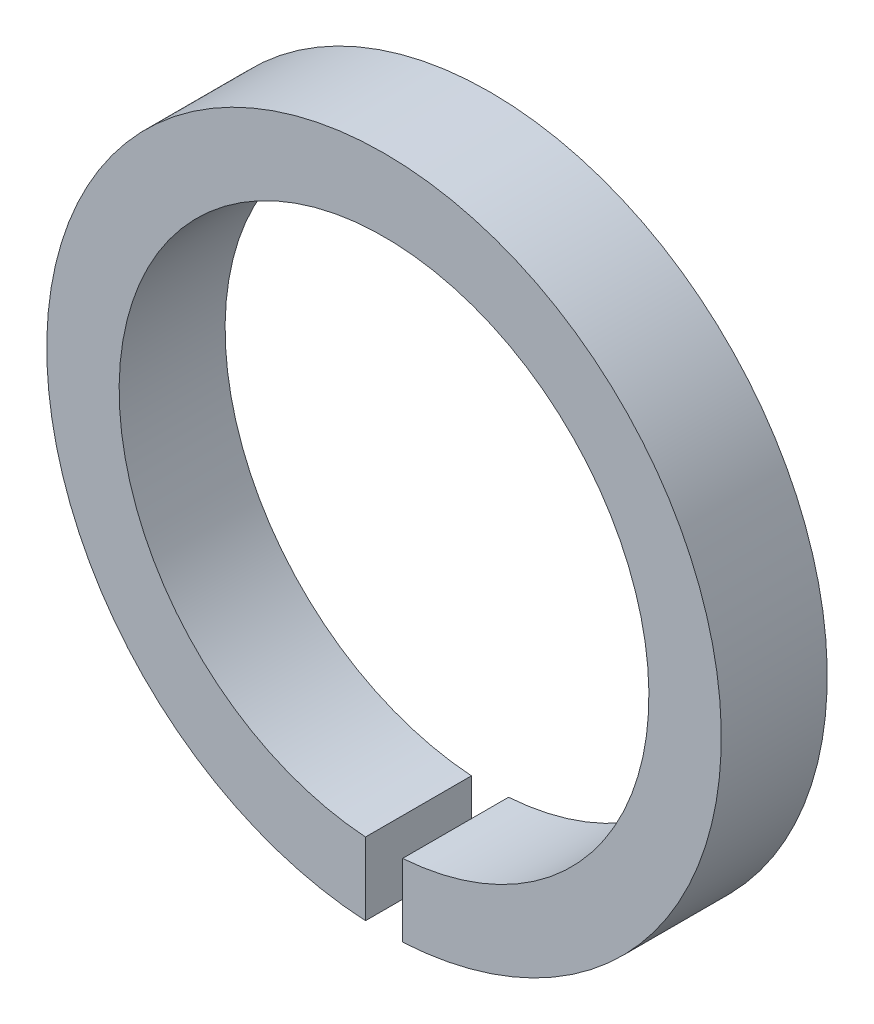
ISO-10303-21;
HEADER;
FILE_DESCRIPTION(('STEP AP214'),'2;1');
FILE_NAME('part.step','',(''),(''),'','','');
FILE_SCHEMA(('AUTOMOTIVE_DESIGN { 1 0 10303 214 1 1 1 1 }'));
ENDSEC;
DATA;
#1=APPLICATION_CONTEXT('core data for automotive mechanical design processes');
#2=APPLICATION_PROTOCOL_DEFINITION('international standard','automotive_design',2000,#1);
#3=PRODUCT_CONTEXT('',#1,'mechanical');
#4=PRODUCT('Part','Part','',(#3));
#5=PRODUCT_RELATED_PRODUCT_CATEGORY('part','',(#4));
#6=PRODUCT_DEFINITION_FORMATION('','',#4);
#7=PRODUCT_DEFINITION_CONTEXT('part definition',#1,'design');
#8=PRODUCT_DEFINITION('design','',#6,#7);
#9=PRODUCT_DEFINITION_SHAPE('','',#8);
#10=(LENGTH_UNIT() NAMED_UNIT(*) SI_UNIT(.MILLI.,.METRE.));
#11=(NAMED_UNIT(*) PLANE_ANGLE_UNIT() SI_UNIT($,.RADIAN.));
#12=(NAMED_UNIT(*) SI_UNIT($,.STERADIAN.) SOLID_ANGLE_UNIT());
#13=UNCERTAINTY_MEASURE_WITH_UNIT(LENGTH_MEASURE(1.E-05),#10,'distance_accuracy_value','');
#14=(GEOMETRIC_REPRESENTATION_CONTEXT(3) GLOBAL_UNCERTAINTY_ASSIGNED_CONTEXT((#13)) GLOBAL_UNIT_ASSIGNED_CONTEXT((#10,
#11,#12)) REPRESENTATION_CONTEXT('',''));
#15=CARTESIAN_POINT('',(0.,0.,0.));
#16=DIRECTION('',(0.,0.,1.));
#17=DIRECTION('',(1.,0.,0.));
#18=AXIS2_PLACEMENT_3D('',#15,#16,#17);
#19=CARTESIAN_POINT('',(0.,0.,5.08));
#20=DIRECTION('',(0.,0.,1.));
#21=DIRECTION('',(1.,0.,0.));
#22=AXIS2_PLACEMENT_3D('',#19,#20,#21);
#23=PLANE('',#22);
#24=DIRECTION('',(0.,-1.,0.));
#25=VECTOR('',#24,1.);
#26=CARTESIAN_POINT('',(-0.889,-0.960137287406383,5.08));
#27=LINE('',#26,#25);
#28=CARTESIAN_POINT('',(-0.888999999999999,-12.6688467904541,5.08));
#29=VERTEX_POINT('',#28);
#30=CARTESIAN_POINT('',(-0.888999999999998,-16.1459628586817,5.08));
#31=VERTEX_POINT('',#30);
#32=EDGE_CURVE('E72',#29,#31,#27,.T.);
#33=ORIENTED_EDGE('',*,*,#32,.F.);
#34=CARTESIAN_POINT('',(0.,0.,5.08));
#35=DIRECTION('',(0.,0.,1.));
#36=DIRECTION('',(1.,0.,0.));
#37=AXIS2_PLACEMENT_3D('',#34,#35,#36);
#38=CIRCLE('',#37,12.7);
#39=CARTESIAN_POINT('',(0.888999999999999,-12.6688467904541,5.08));
#40=VERTEX_POINT('',#39);
#41=EDGE_CURVE('E81',#40,#29,#38,.T.);
#42=ORIENTED_EDGE('',*,*,#41,.F.);
#43=DIRECTION('',(0.,1.,0.));
#44=VECTOR('',#43,1.);
#45=CARTESIAN_POINT('',(0.889,-0.960137287406383,5.08));
#46=LINE('',#45,#44);
#47=CARTESIAN_POINT('',(0.888999999999998,-16.1459628586817,5.08));
#48=VERTEX_POINT('',#47);
#49=EDGE_CURVE('E55',#48,#40,#46,.T.);
#50=ORIENTED_EDGE('',*,*,#49,.F.);
#51=CARTESIAN_POINT('',(0.,0.,5.08));
#52=DIRECTION('',(0.,0.,1.));
#53=DIRECTION('',(1.,0.,0.));
#54=AXIS2_PLACEMENT_3D('',#51,#52,#53);
#55=CIRCLE('',#54,16.170418597981);
#56=EDGE_CURVE('E83',#48,#31,#55,.T.);
#57=ORIENTED_EDGE('',*,*,#56,.T.);
#58=EDGE_LOOP('',(#33,#42,#50,#57));
#59=FACE_BOUND('',#58,.T.);
#60=ADVANCED_FACE('F33',(#59),#23,.T.);
#61=CARTESIAN_POINT('',(0.,0.,0.));
#62=DIRECTION('',(0.,0.,1.));
#63=DIRECTION('',(1.,0.,0.));
#64=AXIS2_PLACEMENT_3D('',#61,#62,#63);
#65=PLANE('',#64);
#66=CARTESIAN_POINT('',(0.,0.,0.));
#67=DIRECTION('',(0.,0.,1.));
#68=DIRECTION('',(1.,0.,0.));
#69=AXIS2_PLACEMENT_3D('',#66,#67,#68);
#70=CIRCLE('',#69,12.7);
#71=CARTESIAN_POINT('',(0.888999999999999,-12.6688467904541,0.));
#72=VERTEX_POINT('',#71);
#73=CARTESIAN_POINT('',(-0.888999999999999,-12.6688467904541,0.));
#74=VERTEX_POINT('',#73);
#75=EDGE_CURVE('E87',#72,#74,#70,.T.);
#76=ORIENTED_EDGE('',*,*,#75,.T.);
#77=DIRECTION('',(0.,-1.,0.));
#78=VECTOR('',#77,1.);
#79=CARTESIAN_POINT('',(-0.889,-0.960137287406383,0.));
#80=LINE('',#79,#78);
#81=CARTESIAN_POINT('',(-0.888999999999998,-16.1459628586817,0.));
#82=VERTEX_POINT('',#81);
#83=EDGE_CURVE('E47',#74,#82,#80,.T.);
#84=ORIENTED_EDGE('',*,*,#83,.T.);
#85=CARTESIAN_POINT('',(0.,0.,0.));
#86=DIRECTION('',(0.,0.,1.));
#87=DIRECTION('',(1.,0.,0.));
#88=AXIS2_PLACEMENT_3D('',#85,#86,#87);
#89=CIRCLE('',#88,16.170418597981);
#90=CARTESIAN_POINT('',(0.888999999999998,-16.1459628586817,0.));
#91=VERTEX_POINT('',#90);
#92=EDGE_CURVE('E86',#91,#82,#89,.T.);
#93=ORIENTED_EDGE('',*,*,#92,.F.);
#94=DIRECTION('',(0.,1.,0.));
#95=VECTOR('',#94,1.);
#96=CARTESIAN_POINT('',(0.889,-0.960137287406383,0.));
#97=LINE('',#96,#95);
#98=EDGE_CURVE('E98',#91,#72,#97,.T.);
#99=ORIENTED_EDGE('',*,*,#98,.T.);
#100=EDGE_LOOP('',(#76,#84,#93,#99));
#101=FACE_BOUND('',#100,.T.);
#102=ADVANCED_FACE('F102',(#101),#65,.F.);
#103=CARTESIAN_POINT('',(0.,0.,5.08));
#104=DIRECTION('',(0.,0.,-1.));
#105=DIRECTION('',(-1.,0.,0.));
#106=AXIS2_PLACEMENT_3D('',#103,#104,#105);
#107=CYLINDRICAL_SURFACE('',#106,16.170418597981);
#108=ORIENTED_EDGE('',*,*,#92,.T.);
#109=DIRECTION('',(0.,0.,-1.));
#110=VECTOR('',#109,1.);
#111=CARTESIAN_POINT('',(-0.888999999999998,-16.1459628586817,5.08));
#112=LINE('',#111,#110);
#113=EDGE_CURVE('E91',#82,#31,#112,.F.);
#114=ORIENTED_EDGE('',*,*,#113,.T.);
#115=ORIENTED_EDGE('',*,*,#56,.F.);
#116=DIRECTION('',(0.,0.,-1.));
#117=VECTOR('',#116,1.);
#118=CARTESIAN_POINT('',(0.888999999999998,-16.1459628586817,5.08));
#119=LINE('',#118,#117);
#120=EDGE_CURVE('E103',#48,#91,#119,.T.);
#121=ORIENTED_EDGE('',*,*,#120,.T.);
#122=EDGE_LOOP('',(#108,#114,#115,#121));
#123=FACE_BOUND('',#122,.T.);
#124=ADVANCED_FACE('F35',(#123),#107,.T.);
#125=CARTESIAN_POINT('',(0.,0.,5.08));
#126=DIRECTION('',(0.,0.,-1.));
#127=DIRECTION('',(-1.,0.,0.));
#128=AXIS2_PLACEMENT_3D('',#125,#126,#127);
#129=CYLINDRICAL_SURFACE('',#128,12.7);
#130=DIRECTION('',(0.,0.,-1.));
#131=VECTOR('',#130,1.);
#132=CARTESIAN_POINT('',(-0.888999999999999,-12.6688467904541,5.08));
#133=LINE('',#132,#131);
#134=EDGE_CURVE('E11',#74,#29,#133,.F.);
#135=ORIENTED_EDGE('',*,*,#134,.F.);
#136=ORIENTED_EDGE('',*,*,#75,.F.);
#137=DIRECTION('',(0.,0.,-1.));
#138=VECTOR('',#137,1.);
#139=CARTESIAN_POINT('',(0.888999999999999,-12.6688467904541,5.08));
#140=LINE('',#139,#138);
#141=EDGE_CURVE('E41',#40,#72,#140,.T.);
#142=ORIENTED_EDGE('',*,*,#141,.F.);
#143=ORIENTED_EDGE('',*,*,#41,.T.);
#144=EDGE_LOOP('',(#135,#136,#142,#143));
#145=FACE_BOUND('',#144,.T.);
#146=ADVANCED_FACE('F85',(#145),#129,.F.);
#147=CARTESIAN_POINT('',(0.889,-0.960137287406383,0.));
#148=DIRECTION('',(1.,0.,0.));
#149=DIRECTION('',(0.,1.,0.));
#150=AXIS2_PLACEMENT_3D('',#147,#148,#149);
#151=PLANE('',#150);
#152=ORIENTED_EDGE('',*,*,#49,.T.);
#153=ORIENTED_EDGE('',*,*,#141,.T.);
#154=ORIENTED_EDGE('',*,*,#98,.F.);
#155=ORIENTED_EDGE('',*,*,#120,.F.);
#156=EDGE_LOOP('',(#152,#153,#154,#155));
#157=FACE_BOUND('',#156,.T.);
#158=ADVANCED_FACE('F97',(#157),#151,.F.);
#159=CARTESIAN_POINT('',(-0.889,-0.960137287406383,0.));
#160=DIRECTION('',(-1.,0.,0.));
#161=DIRECTION('',(0.,-1.,0.));
#162=AXIS2_PLACEMENT_3D('',#159,#160,#161);
#163=PLANE('',#162);
#164=ORIENTED_EDGE('',*,*,#83,.F.);
#165=ORIENTED_EDGE('',*,*,#134,.T.);
#166=ORIENTED_EDGE('',*,*,#32,.T.);
#167=ORIENTED_EDGE('',*,*,#113,.F.);
#168=EDGE_LOOP('',(#164,#165,#166,#167));
#169=FACE_BOUND('',#168,.T.);
#170=ADVANCED_FACE('F71',(#169),#163,.F.);
#171=CLOSED_SHELL('',(#60,#102,#124,#146,#158,#170));
#172=MANIFOLD_SOLID_BREP('B2',#171);
#173=ADVANCED_BREP_SHAPE_REPRESENTATION('',(#18,#172),#14);
#174=SHAPE_DEFINITION_REPRESENTATION(#9,#173);
ENDSEC;
END-ISO-10303-21;
